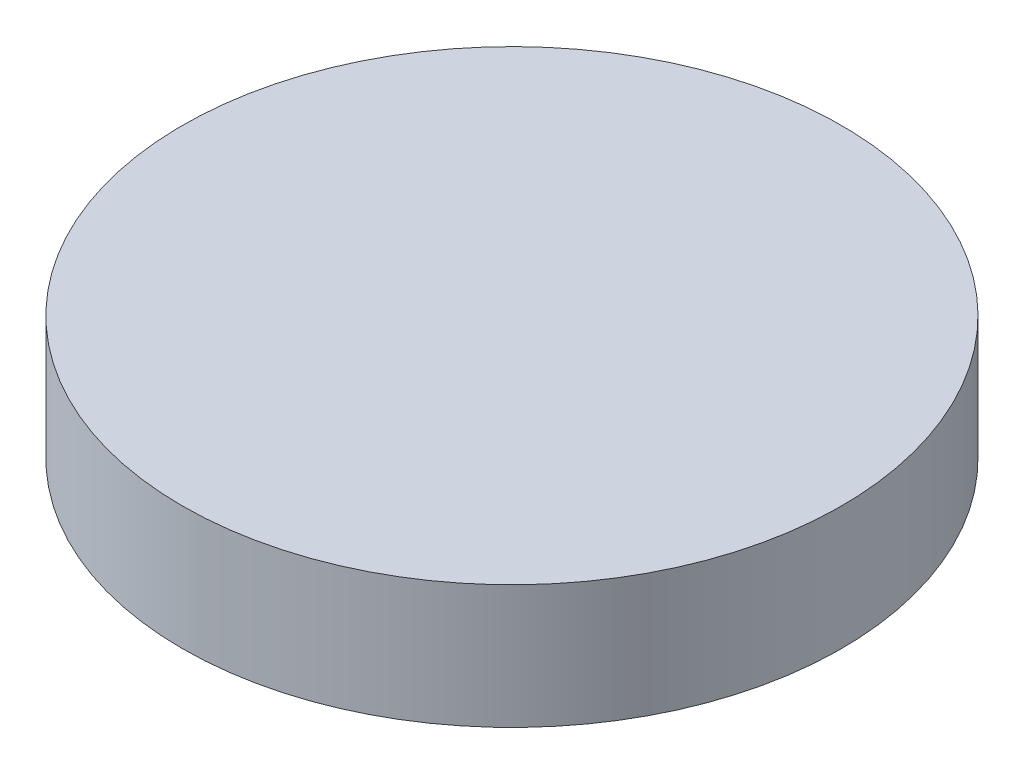
ISO-10303-21;
HEADER;
FILE_DESCRIPTION(('STEP AP214'),'2;1');
FILE_NAME('part.step','',(''),(''),'','','');
FILE_SCHEMA(('AUTOMOTIVE_DESIGN { 1 0 10303 214 1 1 1 1 }'));
ENDSEC;
DATA;
#1=APPLICATION_CONTEXT('core data for automotive mechanical design processes');
#2=APPLICATION_PROTOCOL_DEFINITION('international standard','automotive_design',2000,#1);
#3=PRODUCT_CONTEXT('',#1,'mechanical');
#4=PRODUCT('Part','Part','',(#3));
#5=PRODUCT_RELATED_PRODUCT_CATEGORY('part','',(#4));
#6=PRODUCT_DEFINITION_FORMATION('','',#4);
#7=PRODUCT_DEFINITION_CONTEXT('part definition',#1,'design');
#8=PRODUCT_DEFINITION('design','',#6,#7);
#9=PRODUCT_DEFINITION_SHAPE('','',#8);
#10=(LENGTH_UNIT() NAMED_UNIT(*) SI_UNIT(.MILLI.,.METRE.));
#11=(NAMED_UNIT(*) PLANE_ANGLE_UNIT() SI_UNIT($,.RADIAN.));
#12=(NAMED_UNIT(*) SI_UNIT($,.STERADIAN.) SOLID_ANGLE_UNIT());
#13=UNCERTAINTY_MEASURE_WITH_UNIT(LENGTH_MEASURE(1.E-05),#10,'distance_accuracy_value','');
#14=(GEOMETRIC_REPRESENTATION_CONTEXT(3) GLOBAL_UNCERTAINTY_ASSIGNED_CONTEXT((#13)) GLOBAL_UNIT_ASSIGNED_CONTEXT((#10,
#11,#12)) REPRESENTATION_CONTEXT('',''));
#15=CARTESIAN_POINT('',(0.,0.,0.));
#16=DIRECTION('',(0.,0.,1.));
#17=DIRECTION('',(1.,0.,0.));
#18=AXIS2_PLACEMENT_3D('',#15,#16,#17);
#19=CARTESIAN_POINT('',(0.,7.5,0.));
#20=DIRECTION('',(0.,-1.,0.));
#21=DIRECTION('',(0.,0.,-1.));
#22=AXIS2_PLACEMENT_3D('',#19,#20,#21);
#23=CYLINDRICAL_SURFACE('',#22,20.);
#24=CARTESIAN_POINT('',(0.,7.5,0.));
#25=DIRECTION('',(0.,1.,0.));
#26=DIRECTION('',(0.,0.,1.));
#27=AXIS2_PLACEMENT_3D('',#24,#25,#26);
#28=CIRCLE('',#27,20.);
#29=CARTESIAN_POINT('',(0.,7.5,20.));
#30=VERTEX_POINT('',#29);
#31=EDGE_CURVE('E10',#30,#30,#28,.T.);
#32=ORIENTED_EDGE('',*,*,#31,.F.);
#33=EDGE_LOOP('',(#32));
#34=FACE_BOUND('',#33,.T.);
#35=CARTESIAN_POINT('',(0.,0.,0.));
#36=DIRECTION('',(0.,1.,0.));
#37=DIRECTION('',(0.,0.,1.));
#38=AXIS2_PLACEMENT_3D('',#35,#36,#37);
#39=CIRCLE('',#38,20.);
#40=CARTESIAN_POINT('',(0.,0.,20.));
#41=VERTEX_POINT('',#40);
#42=EDGE_CURVE('E40',#41,#41,#39,.T.);
#43=ORIENTED_EDGE('',*,*,#42,.T.);
#44=EDGE_LOOP('',(#43));
#45=FACE_BOUND('',#44,.T.);
#46=ADVANCED_FACE('F37',(#34,#45),#23,.T.);
#47=CARTESIAN_POINT('',(0.,7.5,0.));
#48=DIRECTION('',(0.,1.,0.));
#49=DIRECTION('',(0.,0.,1.));
#50=AXIS2_PLACEMENT_3D('',#47,#48,#49);
#51=PLANE('',#50);
#52=ORIENTED_EDGE('',*,*,#31,.T.);
#53=EDGE_LOOP('',(#52));
#54=FACE_BOUND('',#53,.T.);
#55=ADVANCED_FACE('F54',(#54),#51,.T.);
#56=CARTESIAN_POINT('',(0.,0.,0.));
#57=DIRECTION('',(0.,1.,0.));
#58=DIRECTION('',(0.,0.,1.));
#59=AXIS2_PLACEMENT_3D('',#56,#57,#58);
#60=PLANE('',#59);
#61=ORIENTED_EDGE('',*,*,#42,.F.);
#62=EDGE_LOOP('',(#61));
#63=FACE_BOUND('',#62,.T.);
#64=ADVANCED_FACE('F52',(#63),#60,.F.);
#65=CLOSED_SHELL('',(#46,#55,#64));
#66=MANIFOLD_SOLID_BREP('B2',#65);
#67=ADVANCED_BREP_SHAPE_REPRESENTATION('',(#18,#66),#14);
#68=SHAPE_DEFINITION_REPRESENTATION(#9,#67);
ENDSEC;
END-ISO-10303-21;
